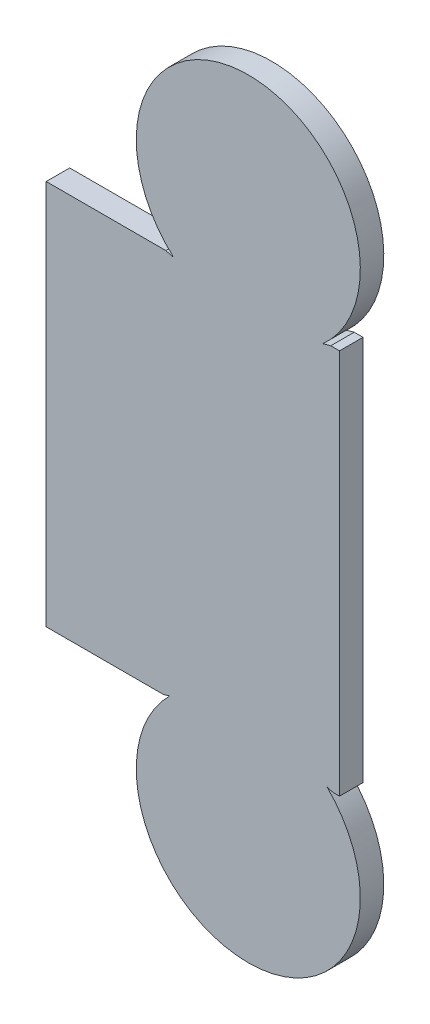
ISO-10303-21;
HEADER;
FILE_DESCRIPTION(('STEP AP214'),'2;1');
FILE_NAME('part.step','',(''),(''),'','','');
FILE_SCHEMA(('AUTOMOTIVE_DESIGN { 1 0 10303 214 1 1 1 1 }'));
ENDSEC;
DATA;
#1=APPLICATION_CONTEXT('core data for automotive mechanical design processes');
#2=APPLICATION_PROTOCOL_DEFINITION('international standard','automotive_design',2000,#1);
#3=PRODUCT_CONTEXT('',#1,'mechanical');
#4=PRODUCT('Part','Part','',(#3));
#5=PRODUCT_RELATED_PRODUCT_CATEGORY('part','',(#4));
#6=PRODUCT_DEFINITION_FORMATION('','',#4);
#7=PRODUCT_DEFINITION_CONTEXT('part definition',#1,'design');
#8=PRODUCT_DEFINITION('design','',#6,#7);
#9=PRODUCT_DEFINITION_SHAPE('','',#8);
#10=(LENGTH_UNIT() NAMED_UNIT(*) SI_UNIT(.MILLI.,.METRE.));
#11=(NAMED_UNIT(*) PLANE_ANGLE_UNIT() SI_UNIT($,.RADIAN.));
#12=(NAMED_UNIT(*) SI_UNIT($,.STERADIAN.) SOLID_ANGLE_UNIT());
#13=UNCERTAINTY_MEASURE_WITH_UNIT(LENGTH_MEASURE(1.E-05),#10,'distance_accuracy_value','');
#14=(GEOMETRIC_REPRESENTATION_CONTEXT(3) GLOBAL_UNCERTAINTY_ASSIGNED_CONTEXT((#13)) GLOBAL_UNIT_ASSIGNED_CONTEXT((#10,
#11,#12)) REPRESENTATION_CONTEXT('',''));
#15=CARTESIAN_POINT('',(0.,0.,0.));
#16=DIRECTION('',(0.,0.,1.));
#17=DIRECTION('',(1.,0.,0.));
#18=AXIS2_PLACEMENT_3D('',#15,#16,#17);
#19=CARTESIAN_POINT('',(181.239551417381,-103.246793579175,283.941063903925));
#20=DIRECTION('',(0.,0.,-1.));
#21=DIRECTION('',(0.,1.,0.));
#22=AXIS2_PLACEMENT_3D('',#19,#20,#21);
#23=CYLINDRICAL_SURFACE('',#22,2.42529676786337);
#24=CARTESIAN_POINT('',(181.239551417381,-103.246793579175,283.432971220494));
#25=DIRECTION('',(0.,0.,-1.));
#26=DIRECTION('',(0.702036634648777,0.712140831304469,0.));
#27=AXIS2_PLACEMENT_3D('',#24,#25,#26);
#28=CIRCLE('',#27,2.42529676786337);
#29=CARTESIAN_POINT('',(182.942198598317,-101.519640722749,283.432971220494));
#30=VERTEX_POINT('',#29);
#31=CARTESIAN_POINT('',(179.536904236446,-101.519640722749,283.432971220494));
#32=VERTEX_POINT('',#31);
#33=EDGE_CURVE('E136',#30,#32,#28,.T.);
#34=ORIENTED_EDGE('',*,*,#33,.F.);
#35=DIRECTION('',(0.,0.,-1.));
#36=VECTOR('',#35,1.);
#37=CARTESIAN_POINT('',(182.942198598317,-101.519640722749,283.941063903925));
#38=LINE('',#37,#36);
#39=CARTESIAN_POINT('',(182.942198598317,-101.519640722749,283.941063903925));
#40=VERTEX_POINT('',#39);
#41=EDGE_CURVE('E32',#40,#30,#38,.T.);
#42=ORIENTED_EDGE('',*,*,#41,.F.);
#43=CARTESIAN_POINT('',(181.239551417381,-103.246793579175,283.941063903925));
#44=DIRECTION('',(0.,0.,-1.));
#45=DIRECTION('',(0.702036634648777,0.712140831304469,0.));
#46=AXIS2_PLACEMENT_3D('',#43,#44,#45);
#47=CIRCLE('',#46,2.42529676786337);
#48=CARTESIAN_POINT('',(179.536904236446,-101.519640722749,283.941063903925));
#49=VERTEX_POINT('',#48);
#50=EDGE_CURVE('E168',#40,#49,#47,.T.);
#51=ORIENTED_EDGE('',*,*,#50,.T.);
#52=DIRECTION('',(0.,0.,-1.));
#53=VECTOR('',#52,1.);
#54=CARTESIAN_POINT('',(179.536904236446,-101.519640722749,283.941063903925));
#55=LINE('',#54,#53);
#56=EDGE_CURVE('E10',#49,#32,#55,.T.);
#57=ORIENTED_EDGE('',*,*,#56,.T.);
#58=EDGE_LOOP('',(#34,#42,#51,#57));
#59=FACE_BOUND('',#58,.T.);
#60=ADVANCED_FACE('F16',(#59),#23,.T.);
#61=CARTESIAN_POINT('',(179.405920498005,-101.559863074311,283.941063903925));
#62=DIRECTION('',(0.29355019531888,-0.955943660906984,0.));
#63=DIRECTION('',(0.955943660906984,0.29355019531888,0.));
#64=AXIS2_PLACEMENT_3D('',#61,#62,#63);
#65=PLANE('',#64);
#66=DIRECTION('',(-0.955943660906984,-0.29355019531888,0.));
#67=VECTOR('',#66,1.);
#68=CARTESIAN_POINT('',(179.405920498005,-101.559863074311,283.432971220494));
#69=LINE('',#68,#67);
#70=CARTESIAN_POINT('',(179.405920498005,-101.559863074311,283.432971220494));
#71=VERTEX_POINT('',#70);
#72=EDGE_CURVE('E139',#32,#71,#69,.T.);
#73=ORIENTED_EDGE('',*,*,#72,.F.);
#74=ORIENTED_EDGE('',*,*,#56,.F.);
#75=DIRECTION('',(-0.955943660906984,-0.29355019531888,0.));
#76=VECTOR('',#75,1.);
#77=CARTESIAN_POINT('',(179.405920498005,-101.559863074311,283.941063903925));
#78=LINE('',#77,#76);
#79=CARTESIAN_POINT('',(179.405920498005,-101.559863074311,283.941063903925));
#80=VERTEX_POINT('',#79);
#81=EDGE_CURVE('E185',#49,#80,#78,.T.);
#82=ORIENTED_EDGE('',*,*,#81,.T.);
#83=DIRECTION('',(0.,0.,-1.));
#84=VECTOR('',#83,1.);
#85=CARTESIAN_POINT('',(179.405920498005,-101.559863074311,283.941063903925));
#86=LINE('',#85,#84);
#87=EDGE_CURVE('E24',#80,#71,#86,.T.);
#88=ORIENTED_EDGE('',*,*,#87,.T.);
#89=EDGE_LOOP('',(#73,#74,#82,#88));
#90=FACE_BOUND('',#89,.T.);
#91=ADVANCED_FACE('F184',(#90),#65,.T.);
#92=CARTESIAN_POINT('',(179.405920498005,-101.559863074311,283.941063903925));
#93=DIRECTION('',(0.,-1.,0.));
#94=DIRECTION('',(0.,0.,-1.));
#95=AXIS2_PLACEMENT_3D('',#92,#93,#94);
#96=PLANE('',#95);
#97=DIRECTION('',(-1.,0.,0.));
#98=VECTOR('',#97,1.);
#99=CARTESIAN_POINT('',(179.405920498005,-101.559863074311,283.432971220494));
#100=LINE('',#99,#98);
#101=CARTESIAN_POINT('',(176.864481922245,-101.559863074311,283.432971220494));
#102=VERTEX_POINT('',#101);
#103=EDGE_CURVE('E142',#71,#102,#100,.T.);
#104=ORIENTED_EDGE('',*,*,#103,.F.);
#105=ORIENTED_EDGE('',*,*,#87,.F.);
#106=DIRECTION('',(-1.,0.,0.));
#107=VECTOR('',#106,1.);
#108=CARTESIAN_POINT('',(179.405920498005,-101.559863074311,283.941063903925));
#109=LINE('',#108,#107);
#110=CARTESIAN_POINT('',(176.864481922245,-101.559863074311,283.941063903925));
#111=VERTEX_POINT('',#110);
#112=EDGE_CURVE('E194',#80,#111,#109,.T.);
#113=ORIENTED_EDGE('',*,*,#112,.T.);
#114=DIRECTION('',(0.,0.,-1.));
#115=VECTOR('',#114,1.);
#116=CARTESIAN_POINT('',(176.864481922245,-101.559863074311,283.941063903925));
#117=LINE('',#116,#115);
#118=EDGE_CURVE('E182',#111,#102,#117,.T.);
#119=ORIENTED_EDGE('',*,*,#118,.T.);
#120=EDGE_LOOP('',(#104,#105,#113,#119));
#121=FACE_BOUND('',#120,.T.);
#122=ADVANCED_FACE('F189',(#121),#96,.T.);
#123=CARTESIAN_POINT('',(176.864481922245,-101.559863074311,283.941063903925));
#124=DIRECTION('',(-1.,0.,0.));
#125=DIRECTION('',(0.,0.,1.));
#126=AXIS2_PLACEMENT_3D('',#123,#124,#125);
#127=PLANE('',#126);
#128=DIRECTION('',(0.,1.,0.));
#129=VECTOR('',#128,1.);
#130=CARTESIAN_POINT('',(176.864481922245,-101.559863074311,283.432971220494));
#131=LINE('',#130,#129);
#132=CARTESIAN_POINT('',(176.864481922245,-93.2097240840388,283.432971220494));
#133=VERTEX_POINT('',#132);
#134=EDGE_CURVE('E145',#102,#133,#131,.T.);
#135=ORIENTED_EDGE('',*,*,#134,.F.);
#136=ORIENTED_EDGE('',*,*,#118,.F.);
#137=DIRECTION('',(0.,1.,0.));
#138=VECTOR('',#137,1.);
#139=CARTESIAN_POINT('',(176.864481922245,-101.559863074311,283.941063903925));
#140=LINE('',#139,#138);
#141=CARTESIAN_POINT('',(176.864481922245,-93.2097240840388,283.941063903925));
#142=VERTEX_POINT('',#141);
#143=EDGE_CURVE('E198',#111,#142,#140,.T.);
#144=ORIENTED_EDGE('',*,*,#143,.T.);
#145=DIRECTION('',(0.,0.,-1.));
#146=VECTOR('',#145,1.);
#147=CARTESIAN_POINT('',(176.864481922245,-93.2097240840388,283.941063903925));
#148=LINE('',#147,#146);
#149=EDGE_CURVE('E180',#142,#133,#148,.T.);
#150=ORIENTED_EDGE('',*,*,#149,.T.);
#151=EDGE_LOOP('',(#135,#136,#144,#150));
#152=FACE_BOUND('',#151,.T.);
#153=ADVANCED_FACE('F233',(#152),#127,.T.);
#154=CARTESIAN_POINT('',(176.864481922245,-93.2097240840388,283.941063903925));
#155=DIRECTION('',(0.,1.,0.));
#156=DIRECTION('',(0.,0.,1.));
#157=AXIS2_PLACEMENT_3D('',#154,#155,#156);
#158=PLANE('',#157);
#159=DIRECTION('',(1.,0.,0.));
#160=VECTOR('',#159,1.);
#161=CARTESIAN_POINT('',(176.864481922245,-93.2097240840388,283.432971220494));
#162=LINE('',#161,#160);
#163=CARTESIAN_POINT('',(179.454350957474,-93.2097240840388,283.432971220494));
#164=VERTEX_POINT('',#163);
#165=EDGE_CURVE('E148',#133,#164,#162,.T.);
#166=ORIENTED_EDGE('',*,*,#165,.F.);
#167=ORIENTED_EDGE('',*,*,#149,.F.);
#168=DIRECTION('',(1.,0.,0.));
#169=VECTOR('',#168,1.);
#170=CARTESIAN_POINT('',(176.864481922245,-93.2097240840388,283.941063903925));
#171=LINE('',#170,#169);
#172=CARTESIAN_POINT('',(179.454350957474,-93.2097240840388,283.941063903925));
#173=VERTEX_POINT('',#172);
#174=EDGE_CURVE('E201',#142,#173,#171,.T.);
#175=ORIENTED_EDGE('',*,*,#174,.T.);
#176=DIRECTION('',(0.,0.,-1.));
#177=VECTOR('',#176,1.);
#178=CARTESIAN_POINT('',(179.454350957474,-93.2097240840388,283.941063903925));
#179=LINE('',#178,#177);
#180=EDGE_CURVE('E178',#173,#164,#179,.T.);
#181=ORIENTED_EDGE('',*,*,#180,.T.);
#182=EDGE_LOOP('',(#166,#167,#175,#181));
#183=FACE_BOUND('',#182,.T.);
#184=ADVANCED_FACE('F231',(#183),#158,.T.);
#185=CARTESIAN_POINT('',(180.096846276387,-93.3850208519022,283.941063903925));
#186=DIRECTION('',(0.263216314621319,0.964736840655093,0.));
#187=DIRECTION('',(-0.964736840655093,0.263216314621319,0.));
#188=AXIS2_PLACEMENT_3D('',#185,#186,#187);
#189=PLANE('',#188);
#190=DIRECTION('',(0.964736840655093,-0.263216314621319,0.));
#191=VECTOR('',#190,1.);
#192=CARTESIAN_POINT('',(180.096846276387,-93.3850208519022,283.432971220494));
#193=LINE('',#192,#191);
#194=CARTESIAN_POINT('',(179.624538733828,-93.256157678567,283.432971220494));
#195=VERTEX_POINT('',#194);
#196=EDGE_CURVE('E151',#164,#195,#193,.T.);
#197=ORIENTED_EDGE('',*,*,#196,.F.);
#198=ORIENTED_EDGE('',*,*,#180,.F.);
#199=DIRECTION('',(0.964736840655093,-0.263216314621319,0.));
#200=VECTOR('',#199,1.);
#201=CARTESIAN_POINT('',(180.096846276387,-93.3850208519022,283.941063903925));
#202=LINE('',#201,#200);
#203=CARTESIAN_POINT('',(179.624538733828,-93.256157678567,283.941063903925));
#204=VERTEX_POINT('',#203);
#205=EDGE_CURVE('E204',#173,#204,#202,.T.);
#206=ORIENTED_EDGE('',*,*,#205,.T.);
#207=DIRECTION('',(0.,0.,-1.));
#208=VECTOR('',#207,1.);
#209=CARTESIAN_POINT('',(179.624538733828,-93.256157678567,283.941063903925));
#210=LINE('',#209,#208);
#211=EDGE_CURVE('E176',#204,#195,#210,.T.);
#212=ORIENTED_EDGE('',*,*,#211,.T.);
#213=EDGE_LOOP('',(#197,#198,#206,#212));
#214=FACE_BOUND('',#213,.T.);
#215=ADVANCED_FACE('F226',(#214),#189,.T.);
#216=CARTESIAN_POINT('',(181.239551417382,-91.446793579175,283.941063903925));
#217=DIRECTION('',(0.,0.,-1.));
#218=DIRECTION('',(0.,1.,0.));
#219=AXIS2_PLACEMENT_3D('',#216,#217,#218);
#220=CYLINDRICAL_SURFACE('',#219,2.42529676786337);
#221=CARTESIAN_POINT('',(181.239551417382,-91.446793579175,283.432971220494));
#222=DIRECTION('',(0.,0.,-1.));
#223=DIRECTION('',(-0.665903119549618,-0.746038226483125,0.));
#224=AXIS2_PLACEMENT_3D('',#221,#222,#223);
#225=CIRCLE('',#224,2.42529676786337);
#226=CARTESIAN_POINT('',(182.854564100935,-93.256157678567,283.432971220494));
#227=VERTEX_POINT('',#226);
#228=EDGE_CURVE('E154',#195,#227,#225,.T.);
#229=ORIENTED_EDGE('',*,*,#228,.F.);
#230=ORIENTED_EDGE('',*,*,#211,.F.);
#231=CARTESIAN_POINT('',(181.239551417382,-91.446793579175,283.941063903925));
#232=DIRECTION('',(0.,0.,-1.));
#233=DIRECTION('',(-0.665903119549618,-0.746038226483125,0.));
#234=AXIS2_PLACEMENT_3D('',#231,#232,#233);
#235=CIRCLE('',#234,2.42529676786337);
#236=CARTESIAN_POINT('',(182.854564100935,-93.256157678567,283.941063903925));
#237=VERTEX_POINT('',#236);
#238=EDGE_CURVE('E207',#204,#237,#235,.T.);
#239=ORIENTED_EDGE('',*,*,#238,.T.);
#240=DIRECTION('',(0.,0.,-1.));
#241=VECTOR('',#240,1.);
#242=CARTESIAN_POINT('',(182.854564100935,-93.256157678567,283.941063903925));
#243=LINE('',#242,#241);
#244=EDGE_CURVE('E174',#237,#227,#243,.T.);
#245=ORIENTED_EDGE('',*,*,#244,.T.);
#246=EDGE_LOOP('',(#229,#230,#239,#245));
#247=FACE_BOUND('',#246,.T.);
#248=ADVANCED_FACE('F223',(#247),#220,.T.);
#249=CARTESIAN_POINT('',(183.024751877289,-93.2097240840388,283.941063903925));
#250=DIRECTION('',(-0.263216314621319,0.964736840655093,0.));
#251=DIRECTION('',(-0.964736840655093,-0.263216314621319,0.));
#252=AXIS2_PLACEMENT_3D('',#249,#250,#251);
#253=PLANE('',#252);
#254=DIRECTION('',(0.964736840655093,0.263216314621319,0.));
#255=VECTOR('',#254,1.);
#256=CARTESIAN_POINT('',(183.024751877289,-93.2097240840388,283.432971220494));
#257=LINE('',#256,#255);
#258=CARTESIAN_POINT('',(183.024751877289,-93.2097240840388,283.432971220494));
#259=VERTEX_POINT('',#258);
#260=EDGE_CURVE('E157',#227,#259,#257,.T.);
#261=ORIENTED_EDGE('',*,*,#260,.F.);
#262=ORIENTED_EDGE('',*,*,#244,.F.);
#263=DIRECTION('',(0.964736840655093,0.263216314621319,0.));
#264=VECTOR('',#263,1.);
#265=CARTESIAN_POINT('',(183.024751877289,-93.2097240840388,283.941063903925));
#266=LINE('',#265,#264);
#267=CARTESIAN_POINT('',(183.024751877289,-93.2097240840388,283.941063903925));
#268=VERTEX_POINT('',#267);
#269=EDGE_CURVE('E210',#237,#268,#266,.T.);
#270=ORIENTED_EDGE('',*,*,#269,.T.);
#271=DIRECTION('',(0.,0.,-1.));
#272=VECTOR('',#271,1.);
#273=CARTESIAN_POINT('',(183.024751877289,-93.2097240840388,283.941063903925));
#274=LINE('',#273,#272);
#275=EDGE_CURVE('E172',#268,#259,#274,.T.);
#276=ORIENTED_EDGE('',*,*,#275,.T.);
#277=EDGE_LOOP('',(#261,#262,#270,#276));
#278=FACE_BOUND('',#277,.T.);
#279=ADVANCED_FACE('F220',(#278),#253,.T.);
#280=CARTESIAN_POINT('',(183.024751877289,-93.2097240840388,283.941063903925));
#281=DIRECTION('',(0.,1.,0.));
#282=DIRECTION('',(0.,0.,1.));
#283=AXIS2_PLACEMENT_3D('',#280,#281,#282);
#284=PLANE('',#283);
#285=DIRECTION('',(1.,0.,0.));
#286=VECTOR('',#285,1.);
#287=CARTESIAN_POINT('',(183.024751877289,-93.2097240840388,283.432971220494));
#288=LINE('',#287,#286);
#289=CARTESIAN_POINT('',(183.214620912518,-93.2097240840388,283.432971220494));
#290=VERTEX_POINT('',#289);
#291=EDGE_CURVE('E160',#259,#290,#288,.T.);
#292=ORIENTED_EDGE('',*,*,#291,.F.);
#293=ORIENTED_EDGE('',*,*,#275,.F.);
#294=DIRECTION('',(1.,0.,0.));
#295=VECTOR('',#294,1.);
#296=CARTESIAN_POINT('',(183.024751877289,-93.2097240840388,283.941063903925));
#297=LINE('',#296,#295);
#298=CARTESIAN_POINT('',(183.214620912518,-93.2097240840388,283.941063903925));
#299=VERTEX_POINT('',#298);
#300=EDGE_CURVE('E127',#268,#299,#297,.T.);
#301=ORIENTED_EDGE('',*,*,#300,.T.);
#302=DIRECTION('',(0.,0.,-1.));
#303=VECTOR('',#302,1.);
#304=CARTESIAN_POINT('',(183.214620912518,-93.2097240840388,283.941063903925));
#305=LINE('',#304,#303);
#306=EDGE_CURVE('E119',#299,#290,#305,.T.);
#307=ORIENTED_EDGE('',*,*,#306,.T.);
#308=EDGE_LOOP('',(#292,#293,#301,#307));
#309=FACE_BOUND('',#308,.T.);
#310=ADVANCED_FACE('F214',(#309),#284,.T.);
#311=CARTESIAN_POINT('',(183.214620912518,-93.2097240840388,283.941063903925));
#312=DIRECTION('',(1.,0.,0.));
#313=DIRECTION('',(0.,0.,-1.));
#314=AXIS2_PLACEMENT_3D('',#311,#312,#313);
#315=PLANE('',#314);
#316=DIRECTION('',(0.,-1.,0.));
#317=VECTOR('',#316,1.);
#318=CARTESIAN_POINT('',(183.214620912518,-93.2097240840388,283.432971220494));
#319=LINE('',#318,#317);
#320=CARTESIAN_POINT('',(183.214620912518,-101.559863074311,283.432971220494));
#321=VERTEX_POINT('',#320);
#322=EDGE_CURVE('E163',#290,#321,#319,.T.);
#323=ORIENTED_EDGE('',*,*,#322,.F.);
#324=ORIENTED_EDGE('',*,*,#306,.F.);
#325=DIRECTION('',(0.,-1.,0.));
#326=VECTOR('',#325,1.);
#327=CARTESIAN_POINT('',(183.214620912518,-93.2097240840388,283.941063903925));
#328=LINE('',#327,#326);
#329=CARTESIAN_POINT('',(183.214620912518,-101.559863074311,283.941063903925));
#330=VERTEX_POINT('',#329);
#331=EDGE_CURVE('E122',#299,#330,#328,.T.);
#332=ORIENTED_EDGE('',*,*,#331,.T.);
#333=DIRECTION('',(0.,0.,-1.));
#334=VECTOR('',#333,1.);
#335=CARTESIAN_POINT('',(183.214620912518,-101.559863074311,283.941063903925));
#336=LINE('',#335,#334);
#337=EDGE_CURVE('E108',#330,#321,#336,.T.);
#338=ORIENTED_EDGE('',*,*,#337,.T.);
#339=EDGE_LOOP('',(#323,#324,#332,#338));
#340=FACE_BOUND('',#339,.T.);
#341=ADVANCED_FACE('F123',(#340),#315,.T.);
#342=CARTESIAN_POINT('',(183.214620912518,-101.559863074311,283.941063903925));
#343=DIRECTION('',(0.,-1.,0.));
#344=DIRECTION('',(0.,0.,-1.));
#345=AXIS2_PLACEMENT_3D('',#342,#343,#344);
#346=PLANE('',#345);
#347=DIRECTION('',(-1.,0.,0.));
#348=VECTOR('',#347,1.);
#349=CARTESIAN_POINT('',(183.214620912518,-101.559863074311,283.432971220494));
#350=LINE('',#349,#348);
#351=CARTESIAN_POINT('',(183.073182336757,-101.559863074311,283.432971220494));
#352=VERTEX_POINT('',#351);
#353=EDGE_CURVE('E115',#321,#352,#350,.T.);
#354=ORIENTED_EDGE('',*,*,#353,.F.);
#355=ORIENTED_EDGE('',*,*,#337,.F.);
#356=DIRECTION('',(-1.,0.,0.));
#357=VECTOR('',#356,1.);
#358=CARTESIAN_POINT('',(183.214620912518,-101.559863074311,283.941063903925));
#359=LINE('',#358,#357);
#360=CARTESIAN_POINT('',(183.073182336757,-101.559863074311,283.941063903925));
#361=VERTEX_POINT('',#360);
#362=EDGE_CURVE('E112',#330,#361,#359,.T.);
#363=ORIENTED_EDGE('',*,*,#362,.T.);
#364=DIRECTION('',(0.,0.,-1.));
#365=VECTOR('',#364,1.);
#366=CARTESIAN_POINT('',(183.073182336757,-101.559863074311,283.941063903925));
#367=LINE('',#366,#365);
#368=EDGE_CURVE('E72',#361,#352,#367,.T.);
#369=ORIENTED_EDGE('',*,*,#368,.T.);
#370=EDGE_LOOP('',(#354,#355,#363,#369));
#371=FACE_BOUND('',#370,.T.);
#372=ADVANCED_FACE('F110',(#371),#346,.T.);
#373=CARTESIAN_POINT('',(182.50232993506,-101.384566306448,283.941063903925));
#374=DIRECTION('',(-0.293550195318854,-0.955943660906992,0.));
#375=DIRECTION('',(0.955943660906992,-0.293550195318854,0.));
#376=AXIS2_PLACEMENT_3D('',#373,#374,#375);
#377=PLANE('',#376);
#378=DIRECTION('',(-0.955943660906992,0.293550195318854,0.));
#379=VECTOR('',#378,1.);
#380=CARTESIAN_POINT('',(182.50232993506,-101.384566306448,283.432971220494));
#381=LINE('',#380,#379);
#382=EDGE_CURVE('E166',#352,#30,#381,.T.);
#383=ORIENTED_EDGE('',*,*,#382,.F.);
#384=ORIENTED_EDGE('',*,*,#368,.F.);
#385=DIRECTION('',(-0.955943660906992,0.293550195318854,0.));
#386=VECTOR('',#385,1.);
#387=CARTESIAN_POINT('',(182.50232993506,-101.384566306448,283.941063903925));
#388=LINE('',#387,#386);
#389=EDGE_CURVE('E131',#361,#40,#388,.T.);
#390=ORIENTED_EDGE('',*,*,#389,.T.);
#391=ORIENTED_EDGE('',*,*,#41,.T.);
#392=EDGE_LOOP('',(#383,#384,#390,#391));
#393=FACE_BOUND('',#392,.T.);
#394=ADVANCED_FACE('F325',(#393),#377,.T.);
#395=CARTESIAN_POINT('',(206.339551417381,-113.096793579175,283.941063903925));
#396=DIRECTION('',(0.,0.,-1.));
#397=DIRECTION('',(0.,1.,0.));
#398=AXIS2_PLACEMENT_3D('',#395,#396,#397);
#399=PLANE('',#398);
#400=ORIENTED_EDGE('',*,*,#50,.F.);
#401=ORIENTED_EDGE('',*,*,#389,.F.);
#402=ORIENTED_EDGE('',*,*,#362,.F.);
#403=ORIENTED_EDGE('',*,*,#331,.F.);
#404=ORIENTED_EDGE('',*,*,#300,.F.);
#405=ORIENTED_EDGE('',*,*,#269,.F.);
#406=ORIENTED_EDGE('',*,*,#238,.F.);
#407=ORIENTED_EDGE('',*,*,#205,.F.);
#408=ORIENTED_EDGE('',*,*,#174,.F.);
#409=ORIENTED_EDGE('',*,*,#143,.F.);
#410=ORIENTED_EDGE('',*,*,#112,.F.);
#411=ORIENTED_EDGE('',*,*,#81,.F.);
#412=EDGE_LOOP('',(#400,#401,#402,#403,#404,#405,#406,#407,#408,#409,#410,#411));
#413=FACE_BOUND('',#412,.T.);
#414=ADVANCED_FACE('F130',(#413),#399,.F.);
#415=CARTESIAN_POINT('',(206.339551417381,-113.096793579175,283.432971220494));
#416=DIRECTION('',(0.,0.,-1.));
#417=DIRECTION('',(0.,1.,0.));
#418=AXIS2_PLACEMENT_3D('',#415,#416,#417);
#419=PLANE('',#418);
#420=ORIENTED_EDGE('',*,*,#33,.T.);
#421=ORIENTED_EDGE('',*,*,#72,.T.);
#422=ORIENTED_EDGE('',*,*,#103,.T.);
#423=ORIENTED_EDGE('',*,*,#134,.T.);
#424=ORIENTED_EDGE('',*,*,#165,.T.);
#425=ORIENTED_EDGE('',*,*,#196,.T.);
#426=ORIENTED_EDGE('',*,*,#228,.T.);
#427=ORIENTED_EDGE('',*,*,#260,.T.);
#428=ORIENTED_EDGE('',*,*,#291,.T.);
#429=ORIENTED_EDGE('',*,*,#322,.T.);
#430=ORIENTED_EDGE('',*,*,#353,.T.);
#431=ORIENTED_EDGE('',*,*,#382,.T.);
#432=EDGE_LOOP('',(#420,#421,#422,#423,#424,#425,#426,#427,#428,#429,#430,#431));
#433=FACE_BOUND('',#432,.T.);
#434=ADVANCED_FACE('F192',(#433),#419,.T.);
#435=CLOSED_SHELL('',(#60,#91,#122,#153,#184,#215,#248,#279,#310,#341,#372,#394,#414,#434));
#436=MANIFOLD_SOLID_BREP('B1',#435);
#437=ADVANCED_BREP_SHAPE_REPRESENTATION('',(#18,#436),#14);
#438=SHAPE_DEFINITION_REPRESENTATION(#9,#437);
ENDSEC;
END-ISO-10303-21;
